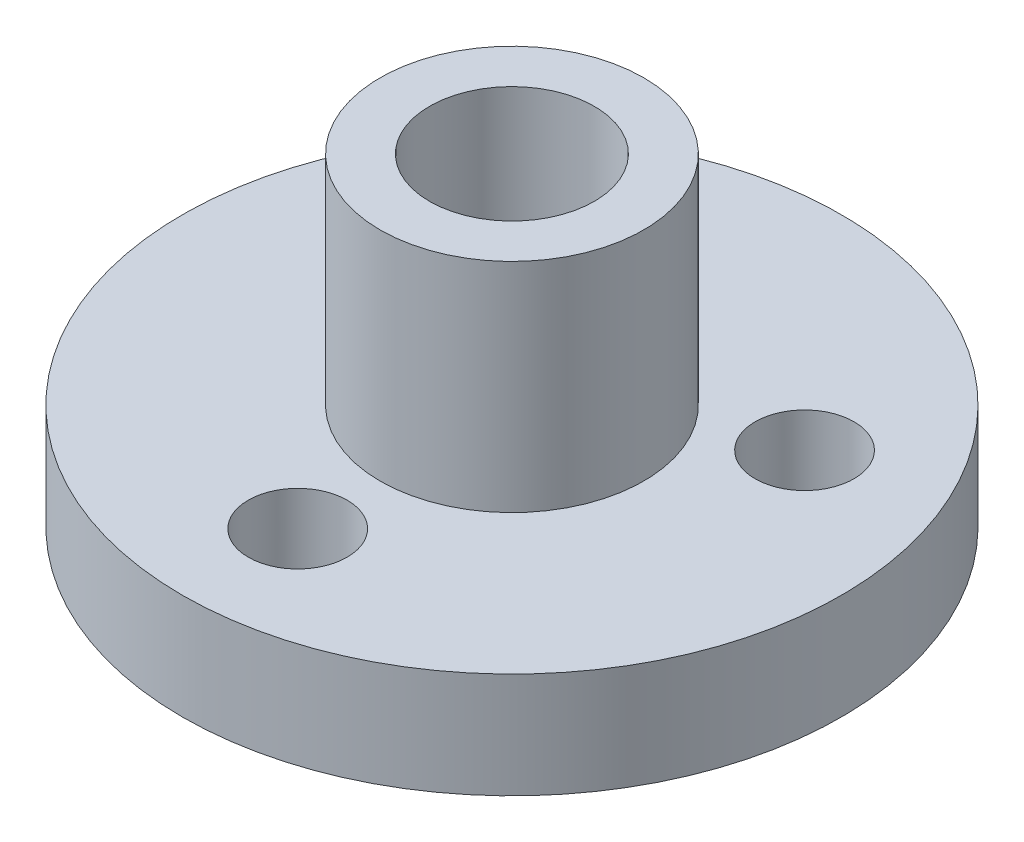
ISO-10303-21;
HEADER;
FILE_DESCRIPTION(('STEP AP214'),'2;1');
FILE_NAME('part.step','',(''),(''),'','','');
FILE_SCHEMA(('AUTOMOTIVE_DESIGN { 1 0 10303 214 1 1 1 1 }'));
ENDSEC;
DATA;
#1=APPLICATION_CONTEXT('core data for automotive mechanical design processes');
#2=APPLICATION_PROTOCOL_DEFINITION('international standard','automotive_design',2000,#1);
#3=PRODUCT_CONTEXT('',#1,'mechanical');
#4=PRODUCT('Part','Part','',(#3));
#5=PRODUCT_RELATED_PRODUCT_CATEGORY('part','',(#4));
#6=PRODUCT_DEFINITION_FORMATION('','',#4);
#7=PRODUCT_DEFINITION_CONTEXT('part definition',#1,'design');
#8=PRODUCT_DEFINITION('design','',#6,#7);
#9=PRODUCT_DEFINITION_SHAPE('','',#8);
#10=(LENGTH_UNIT() NAMED_UNIT(*) SI_UNIT(.MILLI.,.METRE.));
#11=(NAMED_UNIT(*) PLANE_ANGLE_UNIT() SI_UNIT($,.RADIAN.));
#12=(NAMED_UNIT(*) SI_UNIT($,.STERADIAN.) SOLID_ANGLE_UNIT());
#13=UNCERTAINTY_MEASURE_WITH_UNIT(LENGTH_MEASURE(1.E-05),#10,'distance_accuracy_value','');
#14=(GEOMETRIC_REPRESENTATION_CONTEXT(3) GLOBAL_UNCERTAINTY_ASSIGNED_CONTEXT((#13)) GLOBAL_UNIT_ASSIGNED_CONTEXT((#10,
#11,#12)) REPRESENTATION_CONTEXT('',''));
#15=CARTESIAN_POINT('',(0.,0.,0.));
#16=DIRECTION('',(0.,0.,1.));
#17=DIRECTION('',(1.,0.,0.));
#18=AXIS2_PLACEMENT_3D('',#15,#16,#17);
#19=CARTESIAN_POINT('',(0.,3.2,0.));
#20=DIRECTION('',(0.,1.,0.));
#21=DIRECTION('',(0.,0.,1.));
#22=AXIS2_PLACEMENT_3D('',#19,#20,#21);
#23=PLANE('',#22);
#24=CARTESIAN_POINT('',(0.,3.2,0.));
#25=DIRECTION('',(0.,1.,0.));
#26=DIRECTION('',(0.,0.,1.));
#27=AXIS2_PLACEMENT_3D('',#24,#25,#26);
#28=CIRCLE('',#27,10.);
#29=CARTESIAN_POINT('',(0.,3.2,10.));
#30=VERTEX_POINT('',#29);
#31=EDGE_CURVE('E10',#30,#30,#28,.T.);
#32=ORIENTED_EDGE('',*,*,#31,.T.);
#33=EDGE_LOOP('',(#32));
#34=FACE_BOUND('',#33,.T.);
#35=CARTESIAN_POINT('',(0.,3.2,6.5));
#36=DIRECTION('',(0.,1.,0.));
#37=DIRECTION('',(0.,0.,1.));
#38=AXIS2_PLACEMENT_3D('',#35,#36,#37);
#39=CIRCLE('',#38,1.5);
#40=CARTESIAN_POINT('',(0.,3.2,8.));
#41=VERTEX_POINT('',#40);
#42=EDGE_CURVE('E47',#41,#41,#39,.F.);
#43=ORIENTED_EDGE('',*,*,#42,.T.);
#44=EDGE_LOOP('',(#43));
#45=FACE_BOUND('',#44,.T.);
#46=CARTESIAN_POINT('',(-5.62916512459888,3.2,-3.24999999999995));
#47=DIRECTION('',(0.,1.,0.));
#48=DIRECTION('',(0.,0.,1.));
#49=AXIS2_PLACEMENT_3D('',#46,#47,#48);
#50=CIRCLE('',#49,1.5);
#51=CARTESIAN_POINT('',(-5.62916512459888,3.2,-1.74999999999995));
#52=VERTEX_POINT('',#51);
#53=EDGE_CURVE('E53',#52,#52,#50,.F.);
#54=ORIENTED_EDGE('',*,*,#53,.T.);
#55=EDGE_LOOP('',(#54));
#56=FACE_BOUND('',#55,.T.);
#57=CARTESIAN_POINT('',(5.62916512459884,3.2,-3.25000000000003));
#58=DIRECTION('',(0.,1.,0.));
#59=DIRECTION('',(0.,0.,1.));
#60=AXIS2_PLACEMENT_3D('',#57,#58,#59);
#61=CIRCLE('',#60,1.5);
#62=CARTESIAN_POINT('',(5.62916512459884,3.2,-1.75000000000003));
#63=VERTEX_POINT('',#62);
#64=EDGE_CURVE('E60',#63,#63,#61,.F.);
#65=ORIENTED_EDGE('',*,*,#64,.T.);
#66=EDGE_LOOP('',(#65));
#67=FACE_BOUND('',#66,.T.);
#68=CARTESIAN_POINT('',(0.,3.2,0.));
#69=DIRECTION('',(0.,1.,0.));
#70=DIRECTION('',(0.,0.,1.));
#71=AXIS2_PLACEMENT_3D('',#68,#69,#70);
#72=CIRCLE('',#71,4.);
#73=CARTESIAN_POINT('',(0.,3.2,4.));
#74=VERTEX_POINT('',#73);
#75=EDGE_CURVE('E65',#74,#74,#72,.T.);
#76=ORIENTED_EDGE('',*,*,#75,.F.);
#77=EDGE_LOOP('',(#76));
#78=FACE_BOUND('',#77,.T.);
#79=ADVANCED_FACE('F31',(#34,#45,#56,#67,#78),#23,.T.);
#80=CARTESIAN_POINT('',(0.,0.,0.));
#81=DIRECTION('',(0.,1.,0.));
#82=DIRECTION('',(0.,0.,1.));
#83=AXIS2_PLACEMENT_3D('',#80,#81,#82);
#84=PLANE('',#83);
#85=CARTESIAN_POINT('',(5.62916512459884,0.,-3.25000000000003));
#86=DIRECTION('',(0.,-1.,0.));
#87=DIRECTION('',(-0.866025403784436,0.,0.500000000000004));
#88=AXIS2_PLACEMENT_3D('',#85,#86,#87);
#89=CIRCLE('',#88,1.5);
#90=CARTESIAN_POINT('',(4.33012701892218,0.,-2.50000000000002));
#91=VERTEX_POINT('',#90);
#92=EDGE_CURVE('E50',#91,#91,#89,.T.);
#93=ORIENTED_EDGE('',*,*,#92,.F.);
#94=EDGE_LOOP('',(#93));
#95=FACE_BOUND('',#94,.T.);
#96=CARTESIAN_POINT('',(-5.62916512459888,0.,-3.24999999999995));
#97=DIRECTION('',(0.,-1.,0.));
#98=DIRECTION('',(0.866025403784443,0.,0.499999999999992));
#99=AXIS2_PLACEMENT_3D('',#96,#97,#98);
#100=CIRCLE('',#99,1.5);
#101=CARTESIAN_POINT('',(-4.33012701892222,0.,-2.49999999999996));
#102=VERTEX_POINT('',#101);
#103=EDGE_CURVE('E56',#102,#102,#100,.T.);
#104=ORIENTED_EDGE('',*,*,#103,.F.);
#105=EDGE_LOOP('',(#104));
#106=FACE_BOUND('',#105,.T.);
#107=CARTESIAN_POINT('',(0.,0.,6.5));
#108=DIRECTION('',(0.,-1.,0.));
#109=DIRECTION('',(0.,0.,-1.));
#110=AXIS2_PLACEMENT_3D('',#107,#108,#109);
#111=CIRCLE('',#110,1.5);
#112=CARTESIAN_POINT('',(0.,0.,5.));
#113=VERTEX_POINT('',#112);
#114=EDGE_CURVE('E46',#113,#113,#111,.T.);
#115=ORIENTED_EDGE('',*,*,#114,.F.);
#116=EDGE_LOOP('',(#115));
#117=FACE_BOUND('',#116,.T.);
#118=CARTESIAN_POINT('',(0.,0.,0.));
#119=DIRECTION('',(0.,1.,0.));
#120=DIRECTION('',(0.,0.,1.));
#121=AXIS2_PLACEMENT_3D('',#118,#119,#120);
#122=CIRCLE('',#121,10.);
#123=CARTESIAN_POINT('',(0.,0.,10.));
#124=VERTEX_POINT('',#123);
#125=EDGE_CURVE('E35',#124,#124,#122,.T.);
#126=ORIENTED_EDGE('',*,*,#125,.F.);
#127=EDGE_LOOP('',(#126));
#128=FACE_BOUND('',#127,.T.);
#129=CARTESIAN_POINT('',(0.,0.,0.));
#130=DIRECTION('',(0.,1.,0.));
#131=DIRECTION('',(0.,0.,1.));
#132=AXIS2_PLACEMENT_3D('',#129,#130,#131);
#133=CIRCLE('',#132,2.5);
#134=CARTESIAN_POINT('',(0.,0.,2.5));
#135=VERTEX_POINT('',#134);
#136=EDGE_CURVE('E42',#135,#135,#133,.T.);
#137=ORIENTED_EDGE('',*,*,#136,.T.);
#138=EDGE_LOOP('',(#137));
#139=FACE_BOUND('',#138,.T.);
#140=ADVANCED_FACE('F92',(#95,#106,#117,#128,#139),#84,.F.);
#141=CARTESIAN_POINT('',(0.,3.2,0.));
#142=DIRECTION('',(0.,-1.,0.));
#143=DIRECTION('',(0.,0.,-1.));
#144=AXIS2_PLACEMENT_3D('',#141,#142,#143);
#145=CYLINDRICAL_SURFACE('',#144,10.);
#146=ORIENTED_EDGE('',*,*,#31,.F.);
#147=EDGE_LOOP('',(#146));
#148=FACE_BOUND('',#147,.T.);
#149=ORIENTED_EDGE('',*,*,#125,.T.);
#150=EDGE_LOOP('',(#149));
#151=FACE_BOUND('',#150,.T.);
#152=ADVANCED_FACE('F33',(#148,#151),#145,.T.);
#153=CARTESIAN_POINT('',(0.,3.2,0.));
#154=DIRECTION('',(0.,-1.,0.));
#155=DIRECTION('',(0.,0.,-1.));
#156=AXIS2_PLACEMENT_3D('',#153,#154,#155);
#157=CYLINDRICAL_SURFACE('',#156,2.5);
#158=ORIENTED_EDGE('',*,*,#136,.F.);
#159=EDGE_LOOP('',(#158));
#160=FACE_BOUND('',#159,.T.);
#161=CARTESIAN_POINT('',(0.,9.8,0.));
#162=DIRECTION('',(0.,1.,0.));
#163=DIRECTION('',(0.,0.,1.));
#164=AXIS2_PLACEMENT_3D('',#161,#162,#163);
#165=CIRCLE('',#164,2.5);
#166=CARTESIAN_POINT('',(0.,9.8,2.5));
#167=VERTEX_POINT('',#166);
#168=EDGE_CURVE('E68',#167,#167,#165,.T.);
#169=ORIENTED_EDGE('',*,*,#168,.T.);
#170=EDGE_LOOP('',(#169));
#171=FACE_BOUND('',#170,.T.);
#172=ADVANCED_FACE('F74',(#160,#171),#157,.F.);
#173=CARTESIAN_POINT('',(0.,3.201,6.5));
#174=DIRECTION('',(0.,-1.,0.));
#175=DIRECTION('',(0.,0.,-1.));
#176=AXIS2_PLACEMENT_3D('',#173,#174,#175);
#177=CYLINDRICAL_SURFACE('',#176,1.5);
#178=ORIENTED_EDGE('',*,*,#42,.F.);
#179=EDGE_LOOP('',(#178));
#180=FACE_BOUND('',#179,.T.);
#181=ORIENTED_EDGE('',*,*,#114,.T.);
#182=EDGE_LOOP('',(#181));
#183=FACE_BOUND('',#182,.T.);
#184=ADVANCED_FACE('F102',(#180,#183),#177,.F.);
#185=CARTESIAN_POINT('',(-5.62916512459888,3.201,-3.24999999999995));
#186=DIRECTION('',(0.,-1.,0.));
#187=DIRECTION('',(0.,0.,-1.));
#188=AXIS2_PLACEMENT_3D('',#185,#186,#187);
#189=CYLINDRICAL_SURFACE('',#188,1.5);
#190=ORIENTED_EDGE('',*,*,#53,.F.);
#191=EDGE_LOOP('',(#190));
#192=FACE_BOUND('',#191,.T.);
#193=ORIENTED_EDGE('',*,*,#103,.T.);
#194=EDGE_LOOP('',(#193));
#195=FACE_BOUND('',#194,.T.);
#196=ADVANCED_FACE('F88',(#192,#195),#189,.F.);
#197=CARTESIAN_POINT('',(5.62916512459884,3.201,-3.25000000000003));
#198=DIRECTION('',(0.,-1.,0.));
#199=DIRECTION('',(0.,0.,-1.));
#200=AXIS2_PLACEMENT_3D('',#197,#198,#199);
#201=CYLINDRICAL_SURFACE('',#200,1.5);
#202=ORIENTED_EDGE('',*,*,#64,.F.);
#203=EDGE_LOOP('',(#202));
#204=FACE_BOUND('',#203,.T.);
#205=ORIENTED_EDGE('',*,*,#92,.T.);
#206=EDGE_LOOP('',(#205));
#207=FACE_BOUND('',#206,.T.);
#208=ADVANCED_FACE('F79',(#204,#207),#201,.F.);
#209=CARTESIAN_POINT('',(0.,9.8,0.));
#210=DIRECTION('',(0.,1.,0.));
#211=DIRECTION('',(0.,0.,1.));
#212=AXIS2_PLACEMENT_3D('',#209,#210,#211);
#213=PLANE('',#212);
#214=CARTESIAN_POINT('',(0.,9.8,0.));
#215=DIRECTION('',(0.,1.,0.));
#216=DIRECTION('',(0.,0.,1.));
#217=AXIS2_PLACEMENT_3D('',#214,#215,#216);
#218=CIRCLE('',#217,4.);
#219=CARTESIAN_POINT('',(0.,9.8,4.));
#220=VERTEX_POINT('',#219);
#221=EDGE_CURVE('E57',#220,#220,#218,.T.);
#222=ORIENTED_EDGE('',*,*,#221,.T.);
#223=EDGE_LOOP('',(#222));
#224=FACE_BOUND('',#223,.T.);
#225=ORIENTED_EDGE('',*,*,#168,.F.);
#226=EDGE_LOOP('',(#225));
#227=FACE_BOUND('',#226,.T.);
#228=ADVANCED_FACE('F76',(#224,#227),#213,.T.);
#229=CARTESIAN_POINT('',(0.,9.8,0.));
#230=DIRECTION('',(0.,-1.,0.));
#231=DIRECTION('',(0.,0.,-1.));
#232=AXIS2_PLACEMENT_3D('',#229,#230,#231);
#233=CYLINDRICAL_SURFACE('',#232,4.);
#234=ORIENTED_EDGE('',*,*,#221,.F.);
#235=EDGE_LOOP('',(#234));
#236=FACE_BOUND('',#235,.T.);
#237=ORIENTED_EDGE('',*,*,#75,.T.);
#238=EDGE_LOOP('',(#237));
#239=FACE_BOUND('',#238,.T.);
#240=ADVANCED_FACE('F78',(#236,#239),#233,.T.);
#241=CLOSED_SHELL('',(#79,#140,#152,#172,#184,#196,#208,#228,#240));
#242=MANIFOLD_SOLID_BREP('B2',#241);
#243=ADVANCED_BREP_SHAPE_REPRESENTATION('',(#18,#242),#14);
#244=SHAPE_DEFINITION_REPRESENTATION(#9,#243);
ENDSEC;
END-ISO-10303-21;
